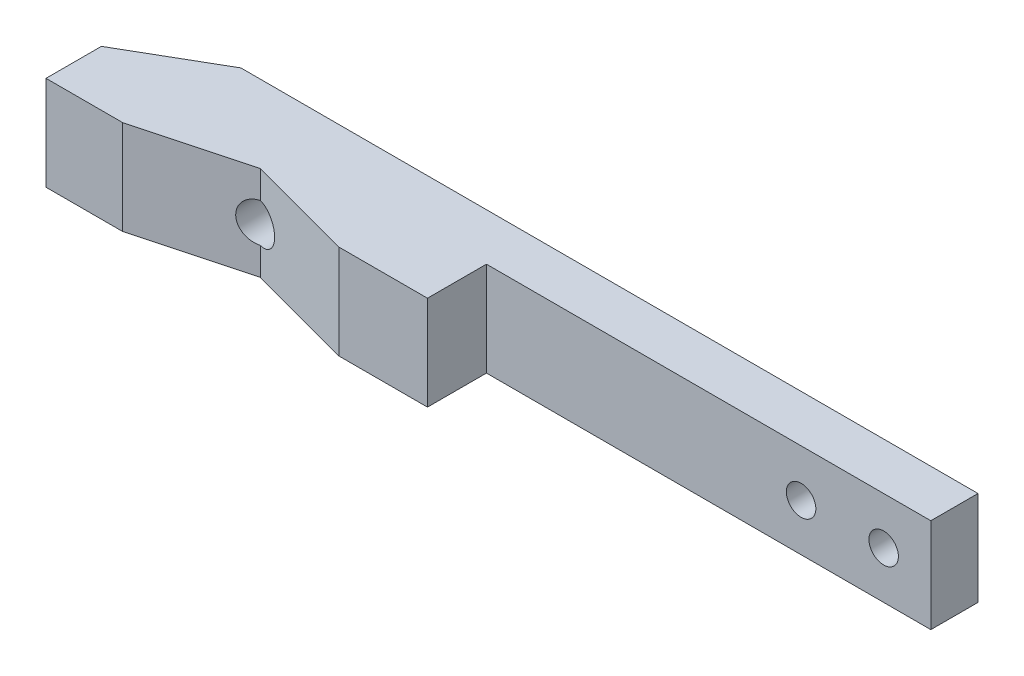
ISO-10303-21;
HEADER;
FILE_DESCRIPTION(('STEP AP214'),'2;1');
FILE_NAME('part.step','',(''),(''),'','','');
FILE_SCHEMA(('AUTOMOTIVE_DESIGN { 1 0 10303 214 1 1 1 1 }'));
ENDSEC;
DATA;
#1=APPLICATION_CONTEXT('core data for automotive mechanical design processes');
#2=APPLICATION_PROTOCOL_DEFINITION('international standard','automotive_design',2000,#1);
#3=PRODUCT_CONTEXT('',#1,'mechanical');
#4=PRODUCT('Part','Part','',(#3));
#5=PRODUCT_RELATED_PRODUCT_CATEGORY('part','',(#4));
#6=PRODUCT_DEFINITION_FORMATION('','',#4);
#7=PRODUCT_DEFINITION_CONTEXT('part definition',#1,'design');
#8=PRODUCT_DEFINITION('design','',#6,#7);
#9=PRODUCT_DEFINITION_SHAPE('','',#8);
#10=(LENGTH_UNIT() NAMED_UNIT(*) SI_UNIT(.MILLI.,.METRE.));
#11=(NAMED_UNIT(*) PLANE_ANGLE_UNIT() SI_UNIT($,.RADIAN.));
#12=(NAMED_UNIT(*) SI_UNIT($,.STERADIAN.) SOLID_ANGLE_UNIT());
#13=UNCERTAINTY_MEASURE_WITH_UNIT(LENGTH_MEASURE(1.E-05),#10,'distance_accuracy_value','');
#14=(GEOMETRIC_REPRESENTATION_CONTEXT(3) GLOBAL_UNCERTAINTY_ASSIGNED_CONTEXT((#13)) GLOBAL_UNIT_ASSIGNED_CONTEXT((#10,
#11,#12)) REPRESENTATION_CONTEXT('',''));
#15=CARTESIAN_POINT('',(0.,0.,0.));
#16=DIRECTION('',(0.,0.,1.));
#17=DIRECTION('',(1.,0.,0.));
#18=AXIS2_PLACEMENT_3D('',#15,#16,#17);
#19=CARTESIAN_POINT('',(-2.2832496067622,8.,3.78779380406026));
#20=DIRECTION('',(0.,0.,-1.));
#21=DIRECTION('',(-1.,0.,0.));
#22=AXIS2_PLACEMENT_3D('',#19,#20,#21);
#23=PLANE('',#22);
#24=CARTESIAN_POINT('',(31.3970466845081,4.,3.78779380406026));
#25=DIRECTION('',(0.,0.,-1.));
#26=DIRECTION('',(-1.,0.,0.));
#27=AXIS2_PLACEMENT_3D('',#24,#25,#26);
#28=CIRCLE('',#27,1.24999999999999);
#29=CARTESIAN_POINT('',(30.1470466845082,4.,3.78779380406026));
#30=VERTEX_POINT('',#29);
#31=EDGE_CURVE('E270',#30,#30,#28,.T.);
#32=ORIENTED_EDGE('',*,*,#31,.T.);
#33=EDGE_LOOP('',(#32));
#34=FACE_BOUND('',#33,.T.);
#35=CARTESIAN_POINT('',(24.3970466845081,4.,3.78779380406026));
#36=DIRECTION('',(0.,0.,-1.));
#37=DIRECTION('',(-1.,0.,0.));
#38=AXIS2_PLACEMENT_3D('',#35,#36,#37);
#39=CIRCLE('',#38,1.24999999999999);
#40=CARTESIAN_POINT('',(23.1470466845082,4.,3.78779380406026));
#41=VERTEX_POINT('',#40);
#42=EDGE_CURVE('E174',#41,#41,#39,.T.);
#43=ORIENTED_EDGE('',*,*,#42,.T.);
#44=EDGE_LOOP('',(#43));
#45=FACE_BOUND('',#44,.T.);
#46=DIRECTION('',(1.,0.,0.));
#47=VECTOR('',#46,1.);
#48=CARTESIAN_POINT('',(-2.2832496067622,0.,3.78779380406026));
#49=LINE('',#48,#47);
#50=CARTESIAN_POINT('',(-2.2832496067622,0.,3.78779380406026));
#51=VERTEX_POINT('',#50);
#52=CARTESIAN_POINT('',(35.3970466845081,0.,3.78779380406026));
#53=VERTEX_POINT('',#52);
#54=EDGE_CURVE('E169',#51,#53,#49,.T.);
#55=ORIENTED_EDGE('',*,*,#54,.T.);
#56=DIRECTION('',(0.,-1.,0.));
#57=VECTOR('',#56,1.);
#58=CARTESIAN_POINT('',(35.3970466845081,8.,3.78779380406026));
#59=LINE('',#58,#57);
#60=CARTESIAN_POINT('',(35.3970466845081,8.,3.78779380406026));
#61=VERTEX_POINT('',#60);
#62=EDGE_CURVE('E11',#61,#53,#59,.T.);
#63=ORIENTED_EDGE('',*,*,#62,.F.);
#64=DIRECTION('',(1.,0.,0.));
#65=VECTOR('',#64,1.);
#66=CARTESIAN_POINT('',(-2.2832496067622,8.,3.78779380406026));
#67=LINE('',#66,#65);
#68=CARTESIAN_POINT('',(-2.2832496067622,8.,3.78779380406026));
#69=VERTEX_POINT('',#68);
#70=EDGE_CURVE('E200',#69,#61,#67,.T.);
#71=ORIENTED_EDGE('',*,*,#70,.F.);
#72=DIRECTION('',(0.,-1.,0.));
#73=VECTOR('',#72,1.);
#74=CARTESIAN_POINT('',(-2.2832496067622,8.,3.78779380406026));
#75=LINE('',#74,#73);
#76=EDGE_CURVE('E165',#69,#51,#75,.T.);
#77=ORIENTED_EDGE('',*,*,#76,.T.);
#78=EDGE_LOOP('',(#55,#63,#71,#77));
#79=FACE_BOUND('',#78,.T.);
#80=ADVANCED_FACE('F47',(#34,#45,#79),#23,.F.);
#81=CARTESIAN_POINT('',(35.3970466845081,8.,-0.212206195939745));
#82=DIRECTION('',(-1.,0.,0.));
#83=DIRECTION('',(0.,0.,1.));
#84=AXIS2_PLACEMENT_3D('',#81,#82,#83);
#85=PLANE('',#84);
#86=DIRECTION('',(0.,0.,-1.));
#87=VECTOR('',#86,1.);
#88=CARTESIAN_POINT('',(35.3970466845081,0.,-0.212206195939745));
#89=LINE('',#88,#87);
#90=CARTESIAN_POINT('',(35.3970466845081,0.,-0.212206195939745));
#91=VERTEX_POINT('',#90);
#92=EDGE_CURVE('E173',#53,#91,#89,.T.);
#93=ORIENTED_EDGE('',*,*,#92,.T.);
#94=DIRECTION('',(0.,-1.,0.));
#95=VECTOR('',#94,1.);
#96=CARTESIAN_POINT('',(35.3970466845081,8.,-0.212206195939745));
#97=LINE('',#96,#95);
#98=CARTESIAN_POINT('',(35.3970466845081,8.,-0.212206195939745));
#99=VERTEX_POINT('',#98);
#100=EDGE_CURVE('E55',#99,#91,#97,.T.);
#101=ORIENTED_EDGE('',*,*,#100,.F.);
#102=DIRECTION('',(0.,0.,-1.));
#103=VECTOR('',#102,1.);
#104=CARTESIAN_POINT('',(35.3970466845081,8.,-0.212206195939745));
#105=LINE('',#104,#103);
#106=EDGE_CURVE('E117',#61,#99,#105,.T.);
#107=ORIENTED_EDGE('',*,*,#106,.F.);
#108=ORIENTED_EDGE('',*,*,#62,.T.);
#109=EDGE_LOOP('',(#93,#101,#107,#108));
#110=FACE_BOUND('',#109,.T.);
#111=ADVANCED_FACE('F292',(#110),#85,.F.);
#112=CARTESIAN_POINT('',(35.3970466845081,8.,-0.212206195939745));
#113=DIRECTION('',(0.,0.,1.));
#114=DIRECTION('',(1.,0.,0.));
#115=AXIS2_PLACEMENT_3D('',#112,#113,#114);
#116=PLANE('',#115);
#117=CARTESIAN_POINT('',(-18.8929333436745,4.,-0.212206195939724));
#118=DIRECTION('',(0.,0.,-1.));
#119=DIRECTION('',(-1.,0.,0.));
#120=AXIS2_PLACEMENT_3D('',#117,#118,#119);
#121=CIRCLE('',#120,1.65);
#122=CARTESIAN_POINT('',(-20.5429333436745,4.,-0.212206195939724));
#123=VERTEX_POINT('',#122);
#124=EDGE_CURVE('E283',#123,#123,#121,.T.);
#125=ORIENTED_EDGE('',*,*,#124,.F.);
#126=EDGE_LOOP('',(#125));
#127=FACE_BOUND('',#126,.T.);
#128=CARTESIAN_POINT('',(31.3970466845081,4.,-0.212206195939745));
#129=DIRECTION('',(0.,0.,-1.));
#130=DIRECTION('',(-1.,0.,0.));
#131=AXIS2_PLACEMENT_3D('',#128,#129,#130);
#132=CIRCLE('',#131,1.24999999999999);
#133=CARTESIAN_POINT('',(30.1470466845082,4.,-0.212206195939745));
#134=VERTEX_POINT('',#133);
#135=EDGE_CURVE('E274',#134,#134,#132,.T.);
#136=ORIENTED_EDGE('',*,*,#135,.F.);
#137=EDGE_LOOP('',(#136));
#138=FACE_BOUND('',#137,.T.);
#139=CARTESIAN_POINT('',(24.3970466845081,4.,-0.212206195939742));
#140=DIRECTION('',(0.,0.,-1.));
#141=DIRECTION('',(-1.,0.,0.));
#142=AXIS2_PLACEMENT_3D('',#139,#140,#141);
#143=CIRCLE('',#142,1.24999999999999);
#144=CARTESIAN_POINT('',(23.1470466845082,4.,-0.212206195939742));
#145=VERTEX_POINT('',#144);
#146=EDGE_CURVE('E266',#145,#145,#143,.T.);
#147=ORIENTED_EDGE('',*,*,#146,.F.);
#148=EDGE_LOOP('',(#147));
#149=FACE_BOUND('',#148,.T.);
#150=DIRECTION('',(-1.,0.,0.));
#151=VECTOR('',#150,1.);
#152=CARTESIAN_POINT('',(35.3970466845081,0.,-0.212206195939745));
#153=LINE('',#152,#151);
#154=CARTESIAN_POINT('',(-27.1033025550541,0.,-0.21220619593972));
#155=VERTEX_POINT('',#154);
#156=EDGE_CURVE('E177',#91,#155,#153,.T.);
#157=ORIENTED_EDGE('',*,*,#156,.T.);
#158=DIRECTION('',(0.,-1.,0.));
#159=VECTOR('',#158,1.);
#160=CARTESIAN_POINT('',(-27.1033025550541,8.,-0.21220619593972));
#161=LINE('',#160,#159);
#162=CARTESIAN_POINT('',(-27.1033025550541,8.,-0.21220619593972));
#163=VERTEX_POINT('',#162);
#164=EDGE_CURVE('E220',#163,#155,#161,.T.);
#165=ORIENTED_EDGE('',*,*,#164,.F.);
#166=DIRECTION('',(-1.,0.,0.));
#167=VECTOR('',#166,1.);
#168=CARTESIAN_POINT('',(35.3970466845081,8.,-0.212206195939745));
#169=LINE('',#168,#167);
#170=EDGE_CURVE('E230',#99,#163,#169,.T.);
#171=ORIENTED_EDGE('',*,*,#170,.F.);
#172=ORIENTED_EDGE('',*,*,#100,.T.);
#173=EDGE_LOOP('',(#157,#165,#171,#172));
#174=FACE_BOUND('',#173,.T.);
#175=ADVANCED_FACE('F228',(#127,#138,#149,#174),#116,.F.);
#176=CARTESIAN_POINT('',(-34.6029333436745,8.,4.11770765869308));
#177=DIRECTION('',(0.500000000000004,0.,0.866025403784436));
#178=DIRECTION('',(0.866025403784436,0.,-0.500000000000004));
#179=AXIS2_PLACEMENT_3D('',#176,#177,#178);
#180=PLANE('',#179);
#181=DIRECTION('',(-0.866025403784436,0.,0.500000000000004));
#182=VECTOR('',#181,1.);
#183=CARTESIAN_POINT('',(-34.6029333436745,0.,4.11770765869308));
#184=LINE('',#183,#182);
#185=CARTESIAN_POINT('',(-34.6029333436745,0.,4.11770765869308));
#186=VERTEX_POINT('',#185);
#187=EDGE_CURVE('E180',#155,#186,#184,.T.);
#188=ORIENTED_EDGE('',*,*,#187,.T.);
#189=DIRECTION('',(0.,-1.,0.));
#190=VECTOR('',#189,1.);
#191=CARTESIAN_POINT('',(-34.6029333436745,8.,4.11770765869308));
#192=LINE('',#191,#190);
#193=CARTESIAN_POINT('',(-34.6029333436745,8.,4.11770765869308));
#194=VERTEX_POINT('',#193);
#195=EDGE_CURVE('E216',#194,#186,#192,.T.);
#196=ORIENTED_EDGE('',*,*,#195,.F.);
#197=DIRECTION('',(-0.866025403784436,0.,0.500000000000004));
#198=VECTOR('',#197,1.);
#199=CARTESIAN_POINT('',(-34.6029333436745,8.,4.11770765869308));
#200=LINE('',#199,#198);
#201=EDGE_CURVE('E249',#163,#194,#200,.T.);
#202=ORIENTED_EDGE('',*,*,#201,.F.);
#203=ORIENTED_EDGE('',*,*,#164,.T.);
#204=EDGE_LOOP('',(#188,#196,#202,#203));
#205=FACE_BOUND('',#204,.T.);
#206=ADVANCED_FACE('F239',(#205),#180,.F.);
#207=CARTESIAN_POINT('',(-34.6029333436745,8.,4.11770765869308));
#208=DIRECTION('',(1.,0.,0.));
#209=DIRECTION('',(0.,0.,-1.));
#210=AXIS2_PLACEMENT_3D('',#207,#208,#209);
#211=PLANE('',#210);
#212=DIRECTION('',(0.,0.,1.));
#213=VECTOR('',#212,1.);
#214=CARTESIAN_POINT('',(-34.6029333436745,0.,4.11770765869308));
#215=LINE('',#214,#213);
#216=CARTESIAN_POINT('',(-34.6029333436745,0.,8.8148447773574));
#217=VERTEX_POINT('',#216);
#218=EDGE_CURVE('E183',#186,#217,#215,.T.);
#219=ORIENTED_EDGE('',*,*,#218,.T.);
#220=DIRECTION('',(0.,-1.,0.));
#221=VECTOR('',#220,1.);
#222=CARTESIAN_POINT('',(-34.6029333436745,8.,8.8148447773574));
#223=LINE('',#222,#221);
#224=CARTESIAN_POINT('',(-34.6029333436745,8.,8.8148447773574));
#225=VERTEX_POINT('',#224);
#226=EDGE_CURVE('E212',#225,#217,#223,.T.);
#227=ORIENTED_EDGE('',*,*,#226,.F.);
#228=DIRECTION('',(0.,0.,1.));
#229=VECTOR('',#228,1.);
#230=CARTESIAN_POINT('',(-34.6029333436745,8.,4.11770765869308));
#231=LINE('',#230,#229);
#232=EDGE_CURVE('E245',#194,#225,#231,.T.);
#233=ORIENTED_EDGE('',*,*,#232,.F.);
#234=ORIENTED_EDGE('',*,*,#195,.T.);
#235=EDGE_LOOP('',(#219,#227,#233,#234));
#236=FACE_BOUND('',#235,.T.);
#237=ADVANCED_FACE('F243',(#236),#211,.F.);
#238=CARTESIAN_POINT('',(-34.6029333436745,8.,8.8148447773574));
#239=DIRECTION('',(0.,0.,-1.));
#240=DIRECTION('',(-1.,0.,0.));
#241=AXIS2_PLACEMENT_3D('',#238,#239,#240);
#242=PLANE('',#241);
#243=DIRECTION('',(1.,0.,0.));
#244=VECTOR('',#243,1.);
#245=CARTESIAN_POINT('',(-34.6029333436745,0.,8.8148447773574));
#246=LINE('',#245,#244);
#247=CARTESIAN_POINT('',(-28.1029333436745,0.,8.8148447773574));
#248=VERTEX_POINT('',#247);
#249=EDGE_CURVE('E186',#217,#248,#246,.T.);
#250=ORIENTED_EDGE('',*,*,#249,.T.);
#251=DIRECTION('',(0.,-1.,0.));
#252=VECTOR('',#251,1.);
#253=CARTESIAN_POINT('',(-28.1029333436745,8.,8.8148447773574));
#254=LINE('',#253,#252);
#255=CARTESIAN_POINT('',(-28.1029333436745,8.,8.8148447773574));
#256=VERTEX_POINT('',#255);
#257=EDGE_CURVE('E208',#256,#248,#254,.T.);
#258=ORIENTED_EDGE('',*,*,#257,.F.);
#259=DIRECTION('',(1.,0.,0.));
#260=VECTOR('',#259,1.);
#261=CARTESIAN_POINT('',(-34.6029333436745,8.,8.8148447773574));
#262=LINE('',#261,#260);
#263=EDGE_CURVE('E248',#225,#256,#262,.T.);
#264=ORIENTED_EDGE('',*,*,#263,.F.);
#265=ORIENTED_EDGE('',*,*,#226,.T.);
#266=EDGE_LOOP('',(#250,#258,#264,#265));
#267=FACE_BOUND('',#266,.T.);
#268=ADVANCED_FACE('F327',(#267),#242,.F.);
#269=CARTESIAN_POINT('',(-28.1029333436745,8.,8.8148447773574));
#270=DIRECTION('',(-0.258819045102521,0.,-0.965925826289068));
#271=DIRECTION('',(-0.965925826289068,0.,0.258819045102521));
#272=AXIS2_PLACEMENT_3D('',#269,#270,#271);
#273=PLANE('',#272);
#274=DIRECTION('',(0.,-1.,0.));
#275=VECTOR('',#274,1.);
#276=CARTESIAN_POINT('',(-18.8926136718488,8.,6.34694705925922));
#277=LINE('',#276,#275);
#278=CARTESIAN_POINT('',(-18.8926136718488,2.35000003096669,6.34694705925922));
#279=VERTEX_POINT('',#278);
#280=CARTESIAN_POINT('',(-18.8926136718488,0.,6.34694705925922));
#281=VERTEX_POINT('',#280);
#282=EDGE_CURVE('E158',#279,#281,#277,.T.);
#283=ORIENTED_EDGE('',*,*,#282,.F.);
#284=CARTESIAN_POINT('',(-18.8929333436745,4.,6.34703271506676));
#285=DIRECTION('',(-0.258819045102521,0.,-0.965925826289068));
#286=DIRECTION('',(0.965925826289068,0.,-0.258819045102521));
#287=AXIS2_PLACEMENT_3D('',#284,#285,#286);
#288=ELLIPSE('',#287,1.70820569767664,1.65);
#289=CARTESIAN_POINT('',(-18.8926136718488,5.64999996903331,6.34694705925922));
#290=VERTEX_POINT('',#289);
#291=EDGE_CURVE('E280',#279,#290,#288,.T.);
#292=ORIENTED_EDGE('',*,*,#291,.T.);
#293=CARTESIAN_POINT('',(-18.8926136718488,8.,6.34694705925922));
#294=VERTEX_POINT('',#293);
#295=EDGE_CURVE('E205',#294,#290,#277,.T.);
#296=ORIENTED_EDGE('',*,*,#295,.F.);
#297=DIRECTION('',(0.965925826289068,0.,-0.258819045102521));
#298=VECTOR('',#297,1.);
#299=CARTESIAN_POINT('',(-28.1029333436745,8.,8.8148447773574));
#300=LINE('',#299,#298);
#301=EDGE_CURVE('E144',#256,#294,#300,.T.);
#302=ORIENTED_EDGE('',*,*,#301,.F.);
#303=ORIENTED_EDGE('',*,*,#257,.T.);
#304=DIRECTION('',(0.965925826289068,0.,-0.258819045102521));
#305=VECTOR('',#304,1.);
#306=CARTESIAN_POINT('',(-28.1029333436745,0.,8.8148447773574));
#307=LINE('',#306,#305);
#308=EDGE_CURVE('E189',#248,#281,#307,.T.);
#309=ORIENTED_EDGE('',*,*,#308,.T.);
#310=EDGE_LOOP('',(#283,#292,#296,#302,#303,#309));
#311=FACE_BOUND('',#310,.T.);
#312=ADVANCED_FACE('F324',(#311),#273,.F.);
#313=CARTESIAN_POINT('',(-9.7832496067622,8.,8.7877938040602));
#314=DIRECTION('',(0.258819045102515,0.,-0.96592582628907));
#315=DIRECTION('',(-0.96592582628907,0.,-0.258819045102515));
#316=AXIS2_PLACEMENT_3D('',#313,#314,#315);
#317=PLANE('',#316);
#318=ORIENTED_EDGE('',*,*,#295,.T.);
#319=CARTESIAN_POINT('',(-18.8929333436745,4.,6.34686140345169));
#320=DIRECTION('',(0.258819045102515,0.,-0.96592582628907));
#321=DIRECTION('',(-0.96592582628907,0.,-0.258819045102515));
#322=AXIS2_PLACEMENT_3D('',#319,#320,#321);
#323=ELLIPSE('',#322,1.70820569767663,1.65);
#324=EDGE_CURVE('E61',#290,#279,#323,.T.);
#325=ORIENTED_EDGE('',*,*,#324,.T.);
#326=ORIENTED_EDGE('',*,*,#282,.T.);
#327=DIRECTION('',(0.96592582628907,0.,0.258819045102515));
#328=VECTOR('',#327,1.);
#329=CARTESIAN_POINT('',(-9.7832496067622,0.,8.7877938040602));
#330=LINE('',#329,#328);
#331=CARTESIAN_POINT('',(-9.7832496067622,0.,8.7877938040602));
#332=VERTEX_POINT('',#331);
#333=EDGE_CURVE('E154',#281,#332,#330,.T.);
#334=ORIENTED_EDGE('',*,*,#333,.T.);
#335=DIRECTION('',(0.,-1.,0.));
#336=VECTOR('',#335,1.);
#337=CARTESIAN_POINT('',(-9.7832496067622,8.,8.7877938040602));
#338=LINE('',#337,#336);
#339=CARTESIAN_POINT('',(-9.7832496067622,8.,8.7877938040602));
#340=VERTEX_POINT('',#339);
#341=EDGE_CURVE('E151',#340,#332,#338,.T.);
#342=ORIENTED_EDGE('',*,*,#341,.F.);
#343=DIRECTION('',(0.96592582628907,0.,0.258819045102515));
#344=VECTOR('',#343,1.);
#345=CARTESIAN_POINT('',(-9.7832496067622,8.,8.7877938040602));
#346=LINE('',#345,#344);
#347=EDGE_CURVE('E137',#294,#340,#346,.T.);
#348=ORIENTED_EDGE('',*,*,#347,.F.);
#349=EDGE_LOOP('',(#318,#325,#326,#334,#342,#348));
#350=FACE_BOUND('',#349,.T.);
#351=ADVANCED_FACE('F152',(#350),#317,.F.);
#352=CARTESIAN_POINT('',(-9.7832496067622,8.,8.7877938040602));
#353=DIRECTION('',(0.,0.,-1.));
#354=DIRECTION('',(-1.,0.,0.));
#355=AXIS2_PLACEMENT_3D('',#352,#353,#354);
#356=PLANE('',#355);
#357=DIRECTION('',(1.,0.,0.));
#358=VECTOR('',#357,1.);
#359=CARTESIAN_POINT('',(-9.7832496067622,0.,8.7877938040602));
#360=LINE('',#359,#358);
#361=CARTESIAN_POINT('',(-2.2832496067622,0.,8.7877938040602));
#362=VERTEX_POINT('',#361);
#363=EDGE_CURVE('E195',#332,#362,#360,.T.);
#364=ORIENTED_EDGE('',*,*,#363,.T.);
#365=DIRECTION('',(0.,-1.,0.));
#366=VECTOR('',#365,1.);
#367=CARTESIAN_POINT('',(-2.2832496067622,8.,8.7877938040602));
#368=LINE('',#367,#366);
#369=CARTESIAN_POINT('',(-2.2832496067622,8.,8.7877938040602));
#370=VERTEX_POINT('',#369);
#371=EDGE_CURVE('E159',#370,#362,#368,.T.);
#372=ORIENTED_EDGE('',*,*,#371,.F.);
#373=DIRECTION('',(1.,0.,0.));
#374=VECTOR('',#373,1.);
#375=CARTESIAN_POINT('',(-9.7832496067622,8.,8.7877938040602));
#376=LINE('',#375,#374);
#377=EDGE_CURVE('E141',#340,#370,#376,.T.);
#378=ORIENTED_EDGE('',*,*,#377,.F.);
#379=ORIENTED_EDGE('',*,*,#341,.T.);
#380=EDGE_LOOP('',(#364,#372,#378,#379));
#381=FACE_BOUND('',#380,.T.);
#382=ADVANCED_FACE('F161',(#381),#356,.F.);
#383=CARTESIAN_POINT('',(-2.2832496067622,8.,8.7877938040602));
#384=DIRECTION('',(-1.,0.,0.));
#385=DIRECTION('',(0.,0.,1.));
#386=AXIS2_PLACEMENT_3D('',#383,#384,#385);
#387=PLANE('',#386);
#388=DIRECTION('',(0.,0.,-1.));
#389=VECTOR('',#388,1.);
#390=CARTESIAN_POINT('',(-2.2832496067622,0.,8.7877938040602));
#391=LINE('',#390,#389);
#392=EDGE_CURVE('E109',#362,#51,#391,.T.);
#393=ORIENTED_EDGE('',*,*,#392,.T.);
#394=ORIENTED_EDGE('',*,*,#76,.F.);
#395=DIRECTION('',(0.,0.,-1.));
#396=VECTOR('',#395,1.);
#397=CARTESIAN_POINT('',(-2.2832496067622,8.,8.7877938040602));
#398=LINE('',#397,#396);
#399=EDGE_CURVE('E70',#370,#69,#398,.T.);
#400=ORIENTED_EDGE('',*,*,#399,.F.);
#401=ORIENTED_EDGE('',*,*,#371,.T.);
#402=EDGE_LOOP('',(#393,#394,#400,#401));
#403=FACE_BOUND('',#402,.T.);
#404=ADVANCED_FACE('F311',(#403),#387,.F.);
#405=CARTESIAN_POINT('',(0.,8.,0.));
#406=DIRECTION('',(0.,-1.,0.));
#407=DIRECTION('',(0.,0.,-1.));
#408=AXIS2_PLACEMENT_3D('',#405,#406,#407);
#409=PLANE('',#408);
#410=ORIENTED_EDGE('',*,*,#70,.T.);
#411=ORIENTED_EDGE('',*,*,#106,.T.);
#412=ORIENTED_EDGE('',*,*,#170,.T.);
#413=ORIENTED_EDGE('',*,*,#201,.T.);
#414=ORIENTED_EDGE('',*,*,#232,.T.);
#415=ORIENTED_EDGE('',*,*,#263,.T.);
#416=ORIENTED_EDGE('',*,*,#301,.T.);
#417=ORIENTED_EDGE('',*,*,#347,.T.);
#418=ORIENTED_EDGE('',*,*,#377,.T.);
#419=ORIENTED_EDGE('',*,*,#399,.T.);
#420=EDGE_LOOP('',(#410,#411,#412,#413,#414,#415,#416,#417,#418,#419));
#421=FACE_BOUND('',#420,.T.);
#422=ADVANCED_FACE('F139',(#421),#409,.F.);
#423=CARTESIAN_POINT('',(0.,0.,0.));
#424=DIRECTION('',(0.,-1.,0.));
#425=DIRECTION('',(0.,0.,-1.));
#426=AXIS2_PLACEMENT_3D('',#423,#424,#425);
#427=PLANE('',#426);
#428=ORIENTED_EDGE('',*,*,#54,.F.);
#429=ORIENTED_EDGE('',*,*,#392,.F.);
#430=ORIENTED_EDGE('',*,*,#363,.F.);
#431=ORIENTED_EDGE('',*,*,#333,.F.);
#432=ORIENTED_EDGE('',*,*,#308,.F.);
#433=ORIENTED_EDGE('',*,*,#249,.F.);
#434=ORIENTED_EDGE('',*,*,#218,.F.);
#435=ORIENTED_EDGE('',*,*,#187,.F.);
#436=ORIENTED_EDGE('',*,*,#156,.F.);
#437=ORIENTED_EDGE('',*,*,#92,.F.);
#438=EDGE_LOOP('',(#428,#429,#430,#431,#432,#433,#434,#435,#436,#437));
#439=FACE_BOUND('',#438,.T.);
#440=ADVANCED_FACE('F234',(#439),#427,.T.);
#441=CARTESIAN_POINT('',(24.3970466845081,4.,-0.212206195939741));
#442=DIRECTION('',(0.,0.,-1.));
#443=DIRECTION('',(-1.,0.,0.));
#444=AXIS2_PLACEMENT_3D('',#441,#442,#443);
#445=CYLINDRICAL_SURFACE('',#444,1.24999999999999);
#446=ORIENTED_EDGE('',*,*,#146,.T.);
#447=EDGE_LOOP('',(#446));
#448=FACE_BOUND('',#447,.T.);
#449=ORIENTED_EDGE('',*,*,#42,.F.);
#450=EDGE_LOOP('',(#449));
#451=FACE_BOUND('',#450,.T.);
#452=ADVANCED_FACE('F298',(#448,#451),#445,.F.);
#453=CARTESIAN_POINT('',(31.3970466845081,4.,-0.212206195939743));
#454=DIRECTION('',(0.,0.,-1.));
#455=DIRECTION('',(-1.,0.,0.));
#456=AXIS2_PLACEMENT_3D('',#453,#454,#455);
#457=CYLINDRICAL_SURFACE('',#456,1.24999999999999);
#458=ORIENTED_EDGE('',*,*,#135,.T.);
#459=EDGE_LOOP('',(#458));
#460=FACE_BOUND('',#459,.T.);
#461=ORIENTED_EDGE('',*,*,#31,.F.);
#462=EDGE_LOOP('',(#461));
#463=FACE_BOUND('',#462,.T.);
#464=ADVANCED_FACE('F301',(#460,#463),#457,.F.);
#465=CARTESIAN_POINT('',(-18.8929333436745,4.,-0.212206195939724));
#466=DIRECTION('',(0.,0.,-1.));
#467=DIRECTION('',(-1.,0.,0.));
#468=AXIS2_PLACEMENT_3D('',#465,#466,#467);
#469=CYLINDRICAL_SURFACE('',#468,1.65);
#470=ORIENTED_EDGE('',*,*,#124,.T.);
#471=EDGE_LOOP('',(#470));
#472=FACE_BOUND('',#471,.T.);
#473=ORIENTED_EDGE('',*,*,#291,.F.);
#474=ORIENTED_EDGE('',*,*,#324,.F.);
#475=EDGE_LOOP('',(#473,#474));
#476=FACE_BOUND('',#475,.T.);
#477=ADVANCED_FACE('F288',(#472,#476),#469,.F.);
#478=CLOSED_SHELL('',(#80,#111,#175,#206,#237,#268,#312,#351,#382,#404,#422,#440,#452,#464,#477));
#479=MANIFOLD_SOLID_BREP('B2',#478);
#480=ADVANCED_BREP_SHAPE_REPRESENTATION('',(#18,#479),#14);
#481=SHAPE_DEFINITION_REPRESENTATION(#9,#480);
ENDSEC;
END-ISO-10303-21;
